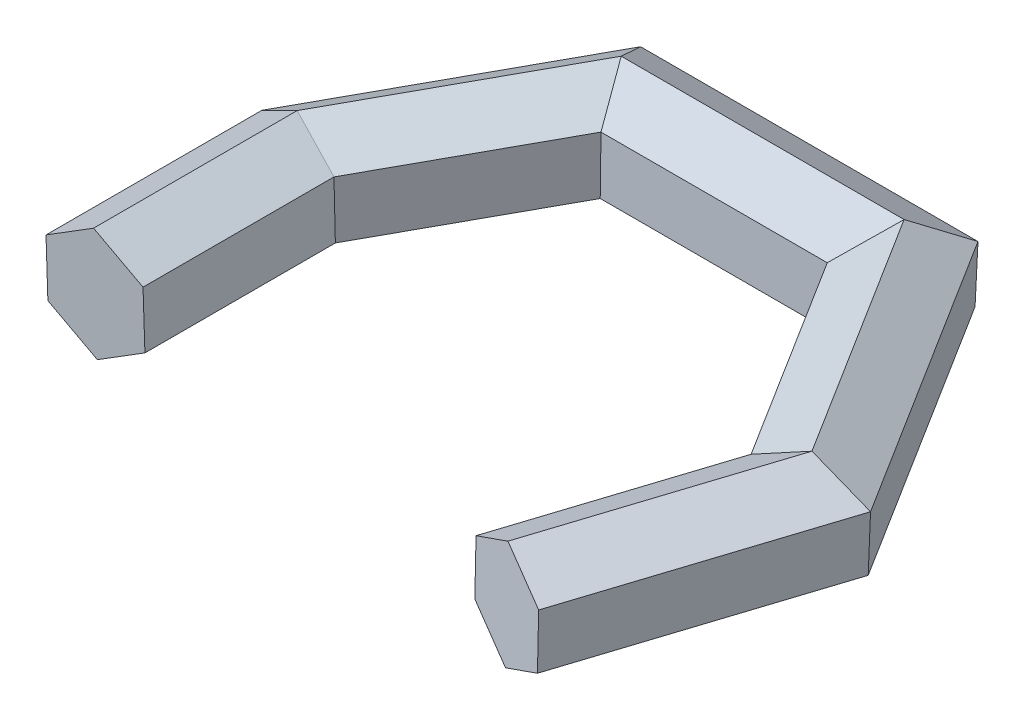
ISO-10303-21;
HEADER;
FILE_DESCRIPTION(('STEP AP214'),'2;1');
FILE_NAME('part.step','',(''),(''),'','','');
FILE_SCHEMA(('AUTOMOTIVE_DESIGN { 1 0 10303 214 1 1 1 1 }'));
ENDSEC;
DATA;
#1=APPLICATION_CONTEXT('core data for automotive mechanical design processes');
#2=APPLICATION_PROTOCOL_DEFINITION('international standard','automotive_design',2000,#1);
#3=PRODUCT_CONTEXT('',#1,'mechanical');
#4=PRODUCT('Part','Part','',(#3));
#5=PRODUCT_RELATED_PRODUCT_CATEGORY('part','',(#4));
#6=PRODUCT_DEFINITION_FORMATION('','',#4);
#7=PRODUCT_DEFINITION_CONTEXT('part definition',#1,'design');
#8=PRODUCT_DEFINITION('design','',#6,#7);
#9=PRODUCT_DEFINITION_SHAPE('','',#8);
#10=(LENGTH_UNIT() NAMED_UNIT(*) SI_UNIT(.MILLI.,.METRE.));
#11=(NAMED_UNIT(*) PLANE_ANGLE_UNIT() SI_UNIT($,.RADIAN.));
#12=(NAMED_UNIT(*) SI_UNIT($,.STERADIAN.) SOLID_ANGLE_UNIT());
#13=UNCERTAINTY_MEASURE_WITH_UNIT(LENGTH_MEASURE(1.E-05),#10,'distance_accuracy_value','');
#14=(GEOMETRIC_REPRESENTATION_CONTEXT(3) GLOBAL_UNCERTAINTY_ASSIGNED_CONTEXT((#13)) GLOBAL_UNIT_ASSIGNED_CONTEXT((#10,
#11,#12)) REPRESENTATION_CONTEXT('',''));
#15=CARTESIAN_POINT('',(0.,0.,0.));
#16=DIRECTION('',(0.,0.,1.));
#17=DIRECTION('',(1.,0.,0.));
#18=AXIS2_PLACEMENT_3D('',#15,#16,#17);
#19=CARTESIAN_POINT('',(84.6727622344032,0.,11.2963649026945));
#20=DIRECTION('',(0.306531366089456,0.,-0.951860557856733));
#21=DIRECTION('',(-0.951860557856733,0.,-0.306531366089456));
#22=AXIS2_PLACEMENT_3D('',#19,#20,#21);
#23=PLANE('',#22);
#24=DIRECTION('',(-0.80780305019403,0.528943693168032,-0.260139965316721));
#25=VECTOR('',#24,1.);
#26=CARTESIAN_POINT('',(84.3515072497639,-9.99430299214722,11.1929099076412));
#27=LINE('',#26,#25);
#28=CARTESIAN_POINT('',(84.3515072497639,-9.99430299214722,11.1929099076412));
#29=VERTEX_POINT('',#28);
#30=CARTESIAN_POINT('',(76.2734767478236,-4.7048660604669,8.59151025447399));
#31=VERTEX_POINT('',#30);
#32=EDGE_CURVE('E135',#29,#31,#27,.T.);
#33=ORIENTED_EDGE('',*,*,#32,.F.);
#34=DIRECTION('',(-0.839928548657958,-0.470486606046691,-0.270485464822054));
#35=VECTOR('',#34,1.);
#36=CARTESIAN_POINT('',(92.7507927363435,-5.28943693168031,13.8977645558617));
#37=LINE('',#36,#35);
#38=CARTESIAN_POINT('',(92.7507927363435,-5.28943693168031,13.8977645558617));
#39=VERTEX_POINT('',#38);
#40=EDGE_CURVE('E142',#39,#29,#37,.T.);
#41=ORIENTED_EDGE('',*,*,#40,.F.);
#42=DIRECTION('',(-0.0321254984639276,-0.999430299214722,-0.0103454995053326));
#43=VECTOR('',#42,1.);
#44=CARTESIAN_POINT('',(93.0720477209828,4.70486606046691,14.0012195509151));
#45=LINE('',#44,#43);
#46=CARTESIAN_POINT('',(93.0720477209828,4.70486606046691,14.0012195509151));
#47=VERTEX_POINT('',#46);
#48=EDGE_CURVE('E151',#47,#39,#45,.T.);
#49=ORIENTED_EDGE('',*,*,#48,.F.);
#50=DIRECTION('',(0.80780305019403,-0.528943693168032,0.260139965316721));
#51=VECTOR('',#50,1.);
#52=CARTESIAN_POINT('',(84.9940172190425,9.99430299214722,11.3998198977478));
#53=LINE('',#52,#51);
#54=CARTESIAN_POINT('',(84.9940172190425,9.99430299214722,11.3998198977479));
#55=VERTEX_POINT('',#54);
#56=EDGE_CURVE('E191',#55,#47,#53,.T.);
#57=ORIENTED_EDGE('',*,*,#56,.F.);
#58=DIRECTION('',(0.839928548657958,0.470486606046691,0.270485464822054));
#59=VECTOR('',#58,1.);
#60=CARTESIAN_POINT('',(76.5947317324629,5.28943693168031,8.69496524952731));
#61=LINE('',#60,#59);
#62=CARTESIAN_POINT('',(76.5947317324629,5.28943693168031,8.69496524952732));
#63=VERTEX_POINT('',#62);
#64=EDGE_CURVE('E188',#63,#55,#61,.T.);
#65=ORIENTED_EDGE('',*,*,#64,.F.);
#66=DIRECTION('',(0.0321254984639277,0.999430299214722,0.0103454995053326));
#67=VECTOR('',#66,1.);
#68=CARTESIAN_POINT('',(76.2734767478236,-4.7048660604669,8.59151025447398));
#69=LINE('',#68,#67);
#70=EDGE_CURVE('E154',#31,#63,#69,.T.);
#71=ORIENTED_EDGE('',*,*,#70,.F.);
#72=EDGE_LOOP('',(#33,#41,#49,#57,#65,#71));
#73=FACE_BOUND('',#72,.T.);
#74=ADVANCED_FACE('F39',(#73),#23,.F.);
#75=CARTESIAN_POINT('',(0.,0.,0.));
#76=DIRECTION('',(0.,0.,1.));
#77=DIRECTION('',(1.,0.,0.));
#78=AXIS2_PLACEMENT_3D('',#75,#76,#77);
#79=PLANE('',#78);
#80=DIRECTION('',(0.848656920939059,0.528943693168032,0.));
#81=VECTOR('',#80,1.);
#82=CARTESIAN_POINT('',(0.33750214985547,-9.99430299214722,0.));
#83=LINE('',#82,#81);
#84=CARTESIAN_POINT('',(0.33750214985547,-9.99430299214722,0.));
#85=VERTEX_POINT('',#84);
#86=CARTESIAN_POINT('',(8.82407135924605,-4.7048660604669,0.));
#87=VERTEX_POINT('',#86);
#88=EDGE_CURVE('E330',#85,#87,#83,.T.);
#89=ORIENTED_EDGE('',*,*,#88,.T.);
#90=DIRECTION('',(-0.0337502149855472,0.999430299214722,0.));
#91=VECTOR('',#90,1.);
#92=CARTESIAN_POINT('',(8.82407135924605,-4.7048660604669,0.));
#93=LINE('',#92,#91);
#94=CARTESIAN_POINT('',(8.48656920939058,5.28943693168031,0.));
#95=VERTEX_POINT('',#94);
#96=EDGE_CURVE('E366',#87,#95,#93,.T.);
#97=ORIENTED_EDGE('',*,*,#96,.T.);
#98=DIRECTION('',(-0.882407135924606,0.470486606046691,0.));
#99=VECTOR('',#98,1.);
#100=CARTESIAN_POINT('',(8.48656920939058,5.28943693168031,0.));
#101=LINE('',#100,#99);
#102=CARTESIAN_POINT('',(-0.337502149855472,9.99430299214722,0.));
#103=VERTEX_POINT('',#102);
#104=EDGE_CURVE('E358',#95,#103,#101,.T.);
#105=ORIENTED_EDGE('',*,*,#104,.T.);
#106=DIRECTION('',(-0.848656920939059,-0.528943693168032,0.));
#107=VECTOR('',#106,1.);
#108=CARTESIAN_POINT('',(-0.337502149855472,9.99430299214722,0.));
#109=LINE('',#108,#107);
#110=CARTESIAN_POINT('',(-8.82407135924605,4.70486606046691,0.));
#111=VERTEX_POINT('',#110);
#112=EDGE_CURVE('E350',#103,#111,#109,.T.);
#113=ORIENTED_EDGE('',*,*,#112,.T.);
#114=DIRECTION('',(0.0337502149855472,-0.999430299214722,0.));
#115=VECTOR('',#114,1.);
#116=CARTESIAN_POINT('',(-8.82407135924605,4.70486606046691,0.));
#117=LINE('',#116,#115);
#118=CARTESIAN_POINT('',(-8.48656920939058,-5.28943693168031,0.));
#119=VERTEX_POINT('',#118);
#120=EDGE_CURVE('E342',#111,#119,#117,.T.);
#121=ORIENTED_EDGE('',*,*,#120,.T.);
#122=DIRECTION('',(0.882407135924606,-0.470486606046691,0.));
#123=VECTOR('',#122,1.);
#124=CARTESIAN_POINT('',(-8.48656920939058,-5.28943693168031,0.));
#125=LINE('',#124,#123);
#126=EDGE_CURVE('E337',#119,#85,#125,.T.);
#127=ORIENTED_EDGE('',*,*,#126,.T.);
#128=EDGE_LOOP('',(#89,#97,#105,#113,#121,#127));
#129=FACE_BOUND('',#128,.T.);
#130=ADVANCED_FACE('F442',(#129),#79,.T.);
#131=CARTESIAN_POINT('',(98.9312600372874,-9.99430299214722,-34.0810592746686));
#132=DIRECTION('',(0.503480638853724,0.848656920939058,0.162137832851199));
#133=DIRECTION('',(-0.860036824777857,0.510231966879792,0.));
#134=AXIS2_PLACEMENT_3D('',#131,#132,#133);
#135=PLANE('',#134);
#136=DIRECTION('',(0.863927714724914,-0.491956600755621,-0.107738603588326));
#137=VECTOR('',#136,1.);
#138=CARTESIAN_POINT('',(79.4073817315499,0.289959399471826,-27.2838531723413));
#139=LINE('',#138,#137);
#140=CARTESIAN_POINT('',(88.1788224204781,-4.7048660604669,-28.3777210448217));
#141=VERTEX_POINT('',#140);
#142=CARTESIAN_POINT('',(97.4676319486953,-9.99430299214722,-29.5361088943036));
#143=VERTEX_POINT('',#142);
#144=EDGE_CURVE('E159',#141,#143,#139,.T.);
#145=ORIENTED_EDGE('',*,*,#144,.T.);
#146=DIRECTION('',(-0.306531366089456,0.,0.951860557856734));
#147=VECTOR('',#146,1.);
#148=CARTESIAN_POINT('',(98.9312600372874,-9.99430299214722,-34.0810592746686));
#149=LINE('',#148,#147);
#150=EDGE_CURVE('E42',#143,#29,#149,.T.);
#151=ORIENTED_EDGE('',*,*,#150,.T.);
#152=ORIENTED_EDGE('',*,*,#32,.T.);
#153=DIRECTION('',(-0.306531366089456,0.,0.951860557856734));
#154=VECTOR('',#153,1.);
#155=CARTESIAN_POINT('',(90.8532295353471,-4.7048660604669,-36.6824589278358));
#156=LINE('',#155,#154);
#157=EDGE_CURVE('E163',#141,#31,#156,.T.);
#158=ORIENTED_EDGE('',*,*,#157,.F.);
#159=EDGE_LOOP('',(#145,#151,#152,#158));
#160=FACE_BOUND('',#159,.T.);
#161=ADVANCED_FACE('F158',(#160),#135,.F.);
#162=CARTESIAN_POINT('',(90.8532295353471,-4.7048660604669,-36.6824589278358));
#163=DIRECTION('',(0.951318282149448,-0.0337502149855472,0.306356734929483));
#164=DIRECTION('',(0.306531366089456,0.,-0.951860557856734));
#165=AXIS2_PLACEMENT_3D('',#162,#163,#164);
#166=PLANE('',#165);
#167=DIRECTION('',(-0.0369360855904055,-0.9993070140383,0.00460622134896585));
#168=VECTOR('',#167,1.);
#169=CARTESIAN_POINT('',(88.1481020171724,-5.53600758525956,-28.3738899681038));
#170=LINE('',#169,#168);
#171=CARTESIAN_POINT('',(88.5482288446787,5.28943693168031,-28.4237889410375));
#172=VERTEX_POINT('',#171);
#173=EDGE_CURVE('E231',#172,#141,#170,.T.);
#174=ORIENTED_EDGE('',*,*,#173,.T.);
#175=ORIENTED_EDGE('',*,*,#157,.T.);
#176=ORIENTED_EDGE('',*,*,#70,.T.);
#177=DIRECTION('',(-0.306531366089456,0.,0.951860557856734));
#178=VECTOR('',#177,1.);
#179=CARTESIAN_POINT('',(91.1744845199864,5.28943693168031,-36.5790039327825));
#180=LINE('',#179,#178);
#181=EDGE_CURVE('E169',#172,#63,#180,.T.);
#182=ORIENTED_EDGE('',*,*,#181,.F.);
#183=EDGE_LOOP('',(#174,#175,#176,#182));
#184=FACE_BOUND('',#183,.T.);
#185=ADVANCED_FACE('F697',(#184),#166,.F.);
#186=CARTESIAN_POINT('',(91.1744845199864,5.28943693168031,-36.5790039327825));
#187=DIRECTION('',(0.447837643295725,-0.882407135924606,0.144218902078284));
#188=DIRECTION('',(0.891729445792908,0.452568884818515,0.));
#189=AXIS2_PLACEMENT_3D('',#186,#187,#188);
#190=PLANE('',#189);
#191=DIRECTION('',(-0.893407972440709,-0.435211313186122,0.111415024364727));
#192=VECTOR('',#191,1.);
#193=CARTESIAN_POINT('',(70.5217361777386,-3.49191916511637,-26.1757430519787));
#194=LINE('',#193,#192);
#195=CARTESIAN_POINT('',(98.2064447970964,9.99430299214722,-29.6282446867353));
#196=VERTEX_POINT('',#195);
#197=EDGE_CURVE('E227',#196,#172,#194,.T.);
#198=ORIENTED_EDGE('',*,*,#197,.T.);
#199=ORIENTED_EDGE('',*,*,#181,.T.);
#200=ORIENTED_EDGE('',*,*,#64,.T.);
#201=DIRECTION('',(-0.306531366089456,0.,0.951860557856734));
#202=VECTOR('',#201,1.);
#203=CARTESIAN_POINT('',(99.573770006566,9.99430299214722,-33.874149284562));
#204=LINE('',#203,#202);
#205=EDGE_CURVE('E174',#196,#55,#204,.T.);
#206=ORIENTED_EDGE('',*,*,#205,.F.);
#207=EDGE_LOOP('',(#198,#199,#200,#206));
#208=FACE_BOUND('',#207,.T.);
#209=ADVANCED_FACE('F688',(#208),#190,.F.);
#210=CARTESIAN_POINT('',(99.573770006566,9.99430299214722,-33.874149284562));
#211=DIRECTION('',(-0.503480638853723,-0.848656920939058,-0.162137832851199));
#212=DIRECTION('',(0.860036824777857,-0.510231966879791,0.));
#213=AXIS2_PLACEMENT_3D('',#210,#211,#212);
#214=PLANE('',#213);
#215=DIRECTION('',(-0.863927714724914,0.491956600755621,0.107738603588326));
#216=VECTOR('',#215,1.);
#217=CARTESIAN_POINT('',(80.0464822018124,20.3353457853742,-27.3635540443531));
#218=LINE('',#217,#216);
#219=CARTESIAN_POINT('',(107.495254325313,4.70486606046691,-30.7866325362172));
#220=VERTEX_POINT('',#219);
#221=EDGE_CURVE('E223',#220,#196,#218,.T.);
#222=ORIENTED_EDGE('',*,*,#221,.T.);
#223=ORIENTED_EDGE('',*,*,#205,.T.);
#224=ORIENTED_EDGE('',*,*,#56,.T.);
#225=DIRECTION('',(-0.306531366089456,0.,0.951860557856734));
#226=VECTOR('',#225,1.);
#227=CARTESIAN_POINT('',(107.651800508506,4.70486606046691,-31.2727496313947));
#228=LINE('',#227,#226);
#229=EDGE_CURVE('E180',#220,#47,#228,.T.);
#230=ORIENTED_EDGE('',*,*,#229,.F.);
#231=EDGE_LOOP('',(#222,#223,#224,#230));
#232=FACE_BOUND('',#231,.T.);
#233=ADVANCED_FACE('F679',(#232),#214,.F.);
#234=CARTESIAN_POINT('',(107.651800508506,4.70486606046691,-31.2727496313947));
#235=DIRECTION('',(-0.951318282149448,0.0337502149855472,-0.306356734929483));
#236=DIRECTION('',(-0.306531366089456,0.,0.951860557856734));
#237=AXIS2_PLACEMENT_3D('',#234,#235,#236);
#238=PLANE('',#237);
#239=DIRECTION('',(0.0369360855904055,0.9993070140383,-0.00460622134896585));
#240=VECTOR('',#239,1.);
#241=CARTESIAN_POINT('',(107.459768641556,3.74479971585141,-30.7822071914224));
#242=LINE('',#241,#240);
#243=CARTESIAN_POINT('',(107.125847901113,-5.28943693168031,-30.7405646400014));
#244=VERTEX_POINT('',#243);
#245=EDGE_CURVE('E219',#244,#220,#242,.T.);
#246=ORIENTED_EDGE('',*,*,#245,.T.);
#247=ORIENTED_EDGE('',*,*,#229,.T.);
#248=ORIENTED_EDGE('',*,*,#48,.T.);
#249=DIRECTION('',(-0.306531366089456,0.,0.951860557856734));
#250=VECTOR('',#249,1.);
#251=CARTESIAN_POINT('',(107.330545523867,-5.28943693168031,-31.3762046264481));
#252=LINE('',#251,#250);
#253=EDGE_CURVE('E147',#244,#39,#252,.T.);
#254=ORIENTED_EDGE('',*,*,#253,.F.);
#255=EDGE_LOOP('',(#246,#247,#248,#254));
#256=FACE_BOUND('',#255,.T.);
#257=ADVANCED_FACE('F671',(#256),#238,.F.);
#258=CARTESIAN_POINT('',(107.330545523867,-5.28943693168031,-31.3762046264481));
#259=DIRECTION('',(-0.447837643295725,0.882407135924606,-0.144218902078284));
#260=DIRECTION('',(-0.891729445792908,-0.452568884818515,0.));
#261=AXIS2_PLACEMENT_3D('',#258,#259,#260);
#262=PLANE('',#261);
#263=DIRECTION('',(0.893407972440709,0.435211313186122,-0.111415024364727));
#264=VECTOR('',#263,1.);
#265=CARTESIAN_POINT('',(86.4180298321003,-15.3769635410675,-28.1581363140078));
#266=LINE('',#265,#264);
#267=EDGE_CURVE('E198',#143,#244,#266,.T.);
#268=ORIENTED_EDGE('',*,*,#267,.T.);
#269=ORIENTED_EDGE('',*,*,#253,.T.);
#270=ORIENTED_EDGE('',*,*,#40,.T.);
#271=ORIENTED_EDGE('',*,*,#150,.F.);
#272=EDGE_LOOP('',(#268,#269,#270,#271));
#273=FACE_BOUND('',#272,.T.);
#274=ADVANCED_FACE('F144',(#273),#262,.F.);
#275=CARTESIAN_POINT('',(74.7343595452675,-5.28943693168031,-82.4423633618317));
#276=DIRECTION('',(-0.398701743172882,0.882407135924606,0.24978904391554));
#277=DIRECTION('',(-0.911294929416716,-0.411754236917342,0.));
#278=AXIS2_PLACEMENT_3D('',#275,#276,#277);
#279=PLANE('',#278);
#280=DIRECTION('',(0.530916376163004,0.,0.847424215798642));
#281=VECTOR('',#280,1.);
#282=CARTESIAN_POINT('',(67.2566277935072,-9.99430299214722,-77.757519372777));
#283=LINE('',#282,#281);
#284=CARTESIAN_POINT('',(70.2614817879104,-9.99430299214722,-72.9613101124796));
#285=VERTEX_POINT('',#284);
#286=EDGE_CURVE('E199',#285,#143,#283,.T.);
#287=ORIENTED_EDGE('',*,*,#286,.F.);
#288=DIRECTION('',(0.438890431470575,0.422751311873756,-0.792878627201283));
#289=VECTOR('',#288,1.);
#290=CARTESIAN_POINT('',(63.4676776594655,-16.5382816300273,-60.6879459546262));
#291=LINE('',#290,#289);
#292=CARTESIAN_POINT('',(75.1459626571412,-5.28943693168031,-81.7853814717257));
#293=VERTEX_POINT('',#292);
#294=EDGE_CURVE('E239',#285,#293,#291,.T.);
#295=ORIENTED_EDGE('',*,*,#294,.T.);
#296=DIRECTION('',(0.530916376163004,0.,0.847424215798642));
#297=VECTOR('',#296,1.);
#298=CARTESIAN_POINT('',(74.7343595452675,-5.28943693168031,-82.4423633618317));
#299=LINE('',#298,#297);
#300=EDGE_CURVE('E162',#293,#244,#299,.T.);
#301=ORIENTED_EDGE('',*,*,#300,.T.);
#302=ORIENTED_EDGE('',*,*,#267,.F.);
#303=EDGE_LOOP('',(#287,#295,#301,#302));
#304=FACE_BOUND('',#303,.T.);
#305=ADVANCED_FACE('F654',(#304),#279,.F.);
#306=CARTESIAN_POINT('',(75.0203670399391,4.70486606046691,-82.6215487801801));
#307=DIRECTION('',(-0.846941437557438,0.0337502149855472,0.530613912686587));
#308=DIRECTION('',(0.530916376163004,0.,0.847424215798642));
#309=AXIS2_PLACEMENT_3D('',#306,#307,#308);
#310=PLANE('',#309);
#311=ORIENTED_EDGE('',*,*,#300,.F.);
#312=DIRECTION('',(0.0186788514928966,0.999255933641991,-0.0337443267554521));
#313=VECTOR('',#312,1.);
#314=CARTESIAN_POINT('',(75.311565817154,3.56977694106128,-82.0845522823794));
#315=LINE('',#314,#313);
#316=CARTESIAN_POINT('',(75.3327837658084,4.70486606046691,-82.1228836215812));
#317=VERTEX_POINT('',#316);
#318=EDGE_CURVE('E266',#293,#317,#315,.T.);
#319=ORIENTED_EDGE('',*,*,#318,.T.);
#320=DIRECTION('',(0.530916376163004,0.,0.847424215798642));
#321=VECTOR('',#320,1.);
#322=CARTESIAN_POINT('',(75.0203670399391,4.70486606046691,-82.6215487801801));
#323=LINE('',#322,#321);
#324=EDGE_CURVE('E167',#317,#220,#323,.T.);
#325=ORIENTED_EDGE('',*,*,#324,.T.);
#326=ORIENTED_EDGE('',*,*,#245,.F.);
#327=EDGE_LOOP('',(#311,#319,#325,#326));
#328=FACE_BOUND('',#327,.T.);
#329=ADVANCED_FACE('F645',(#328),#310,.F.);
#330=CARTESIAN_POINT('',(67.8286427828504,9.99430299214722,-78.115890209474));
#331=DIRECTION('',(-0.448239694384557,-0.848656920939058,0.280824868771047));
#332=DIRECTION('',(0.884239580565024,-0.467033579266193,0.));
#333=AXIS2_PLACEMENT_3D('',#330,#331,#332);
#334=PLANE('',#333);
#335=ORIENTED_EDGE('',*,*,#324,.F.);
#336=DIRECTION('',(-0.425187640079088,0.478749701118952,0.768123814500299));
#337=VECTOR('',#336,1.);
#338=CARTESIAN_POINT('',(60.4901708657505,21.4172438906533,-55.3089234701921));
#339=LINE('',#338,#337);
#340=CARTESIAN_POINT('',(70.6351240052448,9.99430299214722,-73.6363144121906));
#341=VERTEX_POINT('',#340);
#342=EDGE_CURVE('E270',#317,#341,#339,.T.);
#343=ORIENTED_EDGE('',*,*,#342,.T.);
#344=DIRECTION('',(0.530916376163004,0.,0.847424215798642));
#345=VECTOR('',#344,1.);
#346=CARTESIAN_POINT('',(67.8286427828504,9.99430299214722,-78.115890209474));
#347=LINE('',#346,#345);
#348=EDGE_CURVE('E210',#341,#196,#347,.T.);
#349=ORIENTED_EDGE('',*,*,#348,.T.);
#350=ORIENTED_EDGE('',*,*,#221,.F.);
#351=EDGE_LOOP('',(#335,#343,#349,#350));
#352=FACE_BOUND('',#351,.T.);
#353=ADVANCED_FACE('F636',(#352),#334,.F.);
#354=CARTESIAN_POINT('',(60.3509110310901,5.28943693168031,-73.4310462204193));
#355=DIRECTION('',(0.398701743172882,-0.882407135924606,-0.24978904391554));
#356=DIRECTION('',(0.911294929416716,0.411754236917342,0.));
#357=AXIS2_PLACEMENT_3D('',#354,#355,#356);
#358=PLANE('',#357);
#359=ORIENTED_EDGE('',*,*,#348,.F.);
#360=DIRECTION('',(-0.438890431470575,-0.422751311873756,0.792878627201283));
#361=VECTOR('',#360,1.);
#362=CARTESIAN_POINT('',(55.8821297838433,-4.21618603643759,-46.9842551130633));
#363=LINE('',#362,#361);
#364=CARTESIAN_POINT('',(65.7506431360141,5.28943693168031,-64.8122430529445));
#365=VERTEX_POINT('',#364);
#366=EDGE_CURVE('E274',#341,#365,#363,.T.);
#367=ORIENTED_EDGE('',*,*,#366,.T.);
#368=DIRECTION('',(0.530916376163004,0.,0.847424215798642));
#369=VECTOR('',#368,1.);
#370=CARTESIAN_POINT('',(60.3509110310901,5.28943693168031,-73.4310462204193));
#371=LINE('',#370,#369);
#372=EDGE_CURVE('E206',#365,#172,#371,.T.);
#373=ORIENTED_EDGE('',*,*,#372,.T.);
#374=ORIENTED_EDGE('',*,*,#197,.F.);
#375=EDGE_LOOP('',(#359,#367,#373,#374));
#376=FACE_BOUND('',#375,.T.);
#377=ADVANCED_FACE('F627',(#376),#358,.F.);
#378=CARTESIAN_POINT('',(60.0649035364185,-4.7048660604669,-73.2518608020708));
#379=DIRECTION('',(0.846941437557438,-0.0337502149855472,-0.530613912686587));
#380=DIRECTION('',(-0.530916376163004,0.,-0.847424215798642));
#381=AXIS2_PLACEMENT_3D('',#378,#379,#380);
#382=PLANE('',#381);
#383=ORIENTED_EDGE('',*,*,#372,.F.);
#384=DIRECTION('',(-0.0186788514928966,-0.999255933641991,0.0337443267554522));
#385=VECTOR('',#384,1.);
#386=CARTESIAN_POINT('',(65.546012464491,-5.65761796632981,-64.4425669919358));
#387=LINE('',#386,#385);
#388=CARTESIAN_POINT('',(65.5638220273468,-4.7048660604669,-64.4747409030891));
#389=VERTEX_POINT('',#388);
#390=EDGE_CURVE('E278',#365,#389,#387,.T.);
#391=ORIENTED_EDGE('',*,*,#390,.T.);
#392=DIRECTION('',(0.530916376163004,0.,0.847424215798642));
#393=VECTOR('',#392,1.);
#394=CARTESIAN_POINT('',(60.0649035364185,-4.7048660604669,-73.2518608020708));
#395=LINE('',#394,#393);
#396=EDGE_CURVE('E202',#389,#141,#395,.T.);
#397=ORIENTED_EDGE('',*,*,#396,.T.);
#398=ORIENTED_EDGE('',*,*,#173,.F.);
#399=EDGE_LOOP('',(#383,#391,#397,#398));
#400=FACE_BOUND('',#399,.T.);
#401=ADVANCED_FACE('F618',(#400),#382,.F.);
#402=CARTESIAN_POINT('',(67.2566277935072,-9.99430299214722,-77.757519372777));
#403=DIRECTION('',(0.448239694384557,0.848656920939058,-0.280824868771047));
#404=DIRECTION('',(-0.884239580565024,0.467033579266193,0.));
#405=AXIS2_PLACEMENT_3D('',#402,#403,#404);
#406=PLANE('',#405);
#407=ORIENTED_EDGE('',*,*,#396,.F.);
#408=DIRECTION('',(0.425187640079088,-0.478749701118952,-0.768123814500299));
#409=VECTOR('',#408,1.);
#410=CARTESIAN_POINT('',(60.1840773807945,1.35257987364855,-54.7559495050637));
#411=LINE('',#410,#409);
#412=EDGE_CURVE('E235',#389,#285,#411,.T.);
#413=ORIENTED_EDGE('',*,*,#412,.T.);
#414=ORIENTED_EDGE('',*,*,#286,.T.);
#415=ORIENTED_EDGE('',*,*,#144,.F.);
#416=EDGE_LOOP('',(#407,#413,#414,#415));
#417=FACE_BOUND('',#416,.T.);
#418=ADVANCED_FACE('F610',(#417),#406,.F.);
#419=CARTESIAN_POINT('',(14.5188557597198,-5.28943693168031,-81.7853814717257));
#420=DIRECTION('',(0.,0.882407135924606,0.470486606046691));
#421=DIRECTION('',(0.,-0.470486606046691,0.882407135924606));
#422=AXIS2_PLACEMENT_3D('',#419,#420,#421);
#423=PLANE('',#422);
#424=DIRECTION('',(1.,0.,0.));
#425=VECTOR('',#424,1.);
#426=CARTESIAN_POINT('',(14.5188557597198,-9.99430299214722,-72.9613101124796));
#427=LINE('',#426,#425);
#428=CARTESIAN_POINT('',(20.5604325998855,-9.99430299214722,-72.9613101124796));
#429=VERTEX_POINT('',#428);
#430=EDGE_CURVE('E240',#429,#285,#427,.T.);
#431=ORIENTED_EDGE('',*,*,#430,.F.);
#432=DIRECTION('',(-0.462743050411294,0.417082825516576,-0.782247266505393));
#433=VECTOR('',#432,1.);
#434=CARTESIAN_POINT('',(26.0241706331903,-14.9189178400368,-63.7250954623504));
#435=LINE('',#434,#433);
#436=CARTESIAN_POINT('',(15.3405003960108,-5.28943693168031,-81.7853814717257));
#437=VERTEX_POINT('',#436);
#438=EDGE_CURVE('E287',#429,#437,#435,.T.);
#439=ORIENTED_EDGE('',*,*,#438,.T.);
#440=DIRECTION('',(1.,0.,0.));
#441=VECTOR('',#440,1.);
#442=CARTESIAN_POINT('',(14.5188557597198,-5.28943693168031,-81.7853814717257));
#443=LINE('',#442,#441);
#444=EDGE_CURVE('E234',#437,#293,#443,.T.);
#445=ORIENTED_EDGE('',*,*,#444,.T.);
#446=ORIENTED_EDGE('',*,*,#294,.F.);
#447=EDGE_LOOP('',(#431,#439,#445,#446));
#448=FACE_BOUND('',#447,.T.);
#449=ADVANCED_FACE('F471',(#448),#423,.F.);
#450=CARTESIAN_POINT('',(14.5188557597198,4.70486606046691,-82.1228836215812));
#451=DIRECTION('',(0.,0.0337502149855472,0.999430299214722));
#452=DIRECTION('',(0.,-0.999430299214722,0.0337502149855472));
#453=AXIS2_PLACEMENT_3D('',#450,#451,#452);
#454=PLANE('',#453);
#455=ORIENTED_EDGE('',*,*,#444,.F.);
#456=DIRECTION('',(-0.0199611636581535,0.99923116884776,-0.0337434904618857));
#457=VECTOR('',#456,1.);
#458=CARTESIAN_POINT('',(15.1608083474961,3.70572481063937,-82.0891431676354));
#459=LINE('',#458,#457);
#460=CARTESIAN_POINT('',(15.1408489801072,4.70486606046691,-82.1228836215812));
#461=VERTEX_POINT('',#460);
#462=EDGE_CURVE('E314',#437,#461,#459,.T.);
#463=ORIENTED_EDGE('',*,*,#462,.T.);
#464=DIRECTION('',(1.,0.,0.));
#465=VECTOR('',#464,1.);
#466=CARTESIAN_POINT('',(14.5188557597198,4.70486606046691,-82.1228836215812));
#467=LINE('',#466,#465);
#468=EDGE_CURVE('E256',#461,#317,#467,.T.);
#469=ORIENTED_EDGE('',*,*,#468,.T.);
#470=ORIENTED_EDGE('',*,*,#318,.F.);
#471=EDGE_LOOP('',(#455,#463,#469,#470));
#472=FACE_BOUND('',#471,.T.);
#473=ADVANCED_FACE('F467',(#472),#454,.F.);
#474=CARTESIAN_POINT('',(14.5188557597198,9.99430299214722,-73.6363144121906));
#475=DIRECTION('',(0.,-0.848656920939059,0.528943693168032));
#476=DIRECTION('',(0.,-0.528943693168032,-0.848656920939059));
#477=AXIS2_PLACEMENT_3D('',#474,#475,#476);
#478=PLANE('',#477);
#479=ORIENTED_EDGE('',*,*,#468,.F.);
#480=DIRECTION('',(0.44866300470271,0.472717516645569,0.758445553528783));
#481=VECTOR('',#480,1.);
#482=CARTESIAN_POINT('',(29.2341541876493,19.5537663914665,-58.2987560310591));
#483=LINE('',#482,#481);
#484=CARTESIAN_POINT('',(20.1611297680784,9.99430299214722,-73.6363144121906));
#485=VERTEX_POINT('',#484);
#486=EDGE_CURVE('E318',#461,#485,#483,.T.);
#487=ORIENTED_EDGE('',*,*,#486,.T.);
#488=DIRECTION('',(1.,0.,0.));
#489=VECTOR('',#488,1.);
#490=CARTESIAN_POINT('',(14.5188557597198,9.99430299214722,-73.6363144121906));
#491=LINE('',#490,#489);
#492=EDGE_CURVE('E252',#485,#341,#491,.T.);
#493=ORIENTED_EDGE('',*,*,#492,.T.);
#494=ORIENTED_EDGE('',*,*,#342,.F.);
#495=EDGE_LOOP('',(#479,#487,#493,#494));
#496=FACE_BOUND('',#495,.T.);
#497=ADVANCED_FACE('F463',(#496),#478,.F.);
#498=CARTESIAN_POINT('',(14.5188557597198,5.28943693168031,-64.8122430529445));
#499=DIRECTION('',(0.,-0.882407135924606,-0.470486606046691));
#500=DIRECTION('',(0.,0.470486606046691,-0.882407135924606));
#501=AXIS2_PLACEMENT_3D('',#498,#499,#500);
#502=PLANE('',#501);
#503=ORIENTED_EDGE('',*,*,#492,.F.);
#504=DIRECTION('',(0.462743050411294,-0.417082825516576,0.782247266505393));
#505=VECTOR('',#504,1.);
#506=CARTESIAN_POINT('',(33.9147354059735,-2.40219371460048,-50.3864343647775));
#507=LINE('',#506,#505);
#508=CARTESIAN_POINT('',(25.3810619719531,5.28943693168031,-64.8122430529445));
#509=VERTEX_POINT('',#508);
#510=EDGE_CURVE('E322',#485,#509,#507,.T.);
#511=ORIENTED_EDGE('',*,*,#510,.T.);
#512=DIRECTION('',(1.,0.,0.));
#513=VECTOR('',#512,1.);
#514=CARTESIAN_POINT('',(14.5188557597198,5.28943693168031,-64.8122430529445));
#515=LINE('',#514,#513);
#516=EDGE_CURVE('E248',#509,#365,#515,.T.);
#517=ORIENTED_EDGE('',*,*,#516,.T.);
#518=ORIENTED_EDGE('',*,*,#366,.F.);
#519=EDGE_LOOP('',(#503,#511,#517,#518));
#520=FACE_BOUND('',#519,.T.);
#521=ADVANCED_FACE('F460',(#520),#502,.F.);
#522=CARTESIAN_POINT('',(14.5188557597198,-4.7048660604669,-64.4747409030891));
#523=DIRECTION('',(0.,-0.0337502149855472,-0.999430299214722));
#524=DIRECTION('',(0.,0.999430299214722,-0.0337502149855472));
#525=AXIS2_PLACEMENT_3D('',#522,#523,#524);
#526=PLANE('',#525);
#527=ORIENTED_EDGE('',*,*,#516,.F.);
#528=DIRECTION('',(0.0199611636581535,-0.99923116884776,0.0337434904618857));
#529=VECTOR('',#528,1.);
#530=CARTESIAN_POINT('',(25.5965130115821,-5.49577568642243,-64.4480323172766));
#531=LINE('',#530,#529);
#532=CARTESIAN_POINT('',(25.5807133878566,-4.7048660604669,-64.4747409030891));
#533=VERTEX_POINT('',#532);
#534=EDGE_CURVE('E326',#509,#533,#531,.T.);
#535=ORIENTED_EDGE('',*,*,#534,.T.);
#536=DIRECTION('',(1.,0.,0.));
#537=VECTOR('',#536,1.);
#538=CARTESIAN_POINT('',(14.5188557597198,-4.7048660604669,-64.4747409030891));
#539=LINE('',#538,#537);
#540=EDGE_CURVE('E244',#533,#389,#539,.T.);
#541=ORIENTED_EDGE('',*,*,#540,.T.);
#542=ORIENTED_EDGE('',*,*,#390,.F.);
#543=EDGE_LOOP('',(#527,#535,#541,#542));
#544=FACE_BOUND('',#543,.T.);
#545=ADVANCED_FACE('F456',(#544),#526,.F.);
#546=CARTESIAN_POINT('',(14.5188557597198,-9.99430299214722,-72.9613101124796));
#547=DIRECTION('',(0.,0.848656920939059,-0.528943693168032));
#548=DIRECTION('',(0.,0.528943693168032,0.848656920939059));
#549=AXIS2_PLACEMENT_3D('',#546,#547,#548);
#550=PLANE('',#549);
#551=ORIENTED_EDGE('',*,*,#540,.F.);
#552=DIRECTION('',(-0.44866300470271,-0.472717516645569,-0.758445553528783));
#553=VECTOR('',#552,1.);
#554=CARTESIAN_POINT('',(29.5530779616467,-0.519528074382858,-57.759629078831));
#555=LINE('',#554,#553);
#556=EDGE_CURVE('E283',#533,#429,#555,.T.);
#557=ORIENTED_EDGE('',*,*,#556,.T.);
#558=ORIENTED_EDGE('',*,*,#430,.T.);
#559=ORIENTED_EDGE('',*,*,#412,.F.);
#560=EDGE_LOOP('',(#551,#557,#558,#559));
#561=FACE_BOUND('',#560,.T.);
#562=ADVANCED_FACE('F566',(#561),#550,.F.);
#563=CARTESIAN_POINT('',(-8.68548150868327,-5.28943693168031,-38.0580944051824));
#564=DIRECTION('',(0.41234348166384,0.882407135924606,0.226562352562549));
#565=DIRECTION('',(-0.905965255367371,0.423352047434678,0.));
#566=AXIS2_PLACEMENT_3D('',#563,#564,#565);
#567=PLANE('',#566);
#568=DIRECTION('',(0.481548995552203,0.,-0.876419171905011));
#569=VECTOR('',#568,1.);
#570=CARTESIAN_POINT('',(-0.951896195182124,-9.99430299214722,-33.8088717054565));
#571=LINE('',#570,#569);
#572=CARTESIAN_POINT('',(0.337502149855471,-9.99430299214722,-36.1555766934249));
#573=VERTEX_POINT('',#572);
#574=EDGE_CURVE('E288',#573,#429,#571,.T.);
#575=ORIENTED_EDGE('',*,*,#574,.F.);
#576=DIRECTION('',(-0.860616238135255,0.458868017385937,-0.220861570396983));
#577=VECTOR('',#576,1.);
#578=CARTESIAN_POINT('',(-1.18378698102229,-9.18317383094384,-36.5459879959139));
#579=LINE('',#578,#577);
#580=CARTESIAN_POINT('',(-8.48656920939058,-5.28943693168031,-38.4201147898951));
#581=VERTEX_POINT('',#580);
#582=EDGE_CURVE('E335',#573,#581,#579,.T.);
#583=ORIENTED_EDGE('',*,*,#582,.T.);
#584=DIRECTION('',(0.481548995552203,0.,-0.876419171905011));
#585=VECTOR('',#584,1.);
#586=CARTESIAN_POINT('',(-8.68548150868327,-5.28943693168031,-38.0580944051824));
#587=LINE('',#586,#585);
#588=EDGE_CURVE('E282',#581,#437,#587,.T.);
#589=ORIENTED_EDGE('',*,*,#588,.T.);
#590=ORIENTED_EDGE('',*,*,#438,.F.);
#591=EDGE_LOOP('',(#575,#583,#589,#590));
#592=FACE_BOUND('',#591,.T.);
#593=ADVANCED_FACE('F474',(#592),#567,.F.);
#594=CARTESIAN_POINT('',(-8.98127486337576,4.70486606046691,-38.220618226442));
#595=DIRECTION('',(0.875919875214544,0.0337502149855472,0.481274656711287));
#596=DIRECTION('',(0.481548995552203,0.,-0.876419171905011));
#597=AXIS2_PLACEMENT_3D('',#594,#595,#596);
#598=PLANE('',#597);
#599=ORIENTED_EDGE('',*,*,#588,.F.);
#600=DIRECTION('',(-0.0337489490941749,0.999392812929271,-0.00866105653820566));
#601=VECTOR('',#600,1.);
#602=CARTESIAN_POINT('',(-8.81281578255057,4.37155960925125,-38.5038400640555));
#603=LINE('',#602,#601);
#604=CARTESIAN_POINT('',(-8.82407135924605,4.70486606046691,-38.5067286039581));
#605=VERTEX_POINT('',#604);
#606=EDGE_CURVE('E385',#581,#605,#603,.T.);
#607=ORIENTED_EDGE('',*,*,#606,.T.);
#608=DIRECTION('',(0.481548995552203,0.,-0.876419171905011));
#609=VECTOR('',#608,1.);
#610=CARTESIAN_POINT('',(-8.98127486337576,4.70486606046691,-38.220618226442));
#611=LINE('',#610,#609);
#612=EDGE_CURVE('E304',#605,#461,#611,.T.);
#613=ORIENTED_EDGE('',*,*,#612,.T.);
#614=ORIENTED_EDGE('',*,*,#462,.F.);
#615=EDGE_LOOP('',(#599,#607,#613,#614));
#616=FACE_BOUND('',#615,.T.);
#617=ADVANCED_FACE('F437',(#616),#598,.F.);
#618=CARTESIAN_POINT('',(-1.54348290456711,9.99430299214722,-34.1339193479757));
#619=DIRECTION('',(0.463576393550704,-0.848656920939058,0.254712304148738));
#620=DIRECTION('',(0.877603008124151,0.479388110127317,0.));
#621=AXIS2_PLACEMENT_3D('',#618,#619,#620);
#622=PLANE('',#621);
#623=ORIENTED_EDGE('',*,*,#612,.F.);
#624=DIRECTION('',(0.829218377877069,0.516828202793385,0.212803878226599));
#625=VECTOR('',#624,1.);
#626=CARTESIAN_POINT('',(6.07311087380351,13.9898555464741,-34.6836365953638));
#627=LINE('',#626,#625);
#628=CARTESIAN_POINT('',(-0.337502149855473,9.99430299214722,-36.3288043215509));
#629=VERTEX_POINT('',#628);
#630=EDGE_CURVE('E389',#605,#629,#627,.T.);
#631=ORIENTED_EDGE('',*,*,#630,.T.);
#632=DIRECTION('',(0.481548995552203,0.,-0.876419171905011));
#633=VECTOR('',#632,1.);
#634=CARTESIAN_POINT('',(-1.54348290456711,9.99430299214722,-34.1339193479757));
#635=LINE('',#634,#633);
#636=EDGE_CURVE('E300',#629,#485,#635,.T.);
#637=ORIENTED_EDGE('',*,*,#636,.T.);
#638=ORIENTED_EDGE('',*,*,#486,.F.);
#639=EDGE_LOOP('',(#623,#631,#637,#638));
#640=FACE_BOUND('',#639,.T.);
#641=ADVANCED_FACE('F433',(#640),#622,.F.);
#642=CARTESIAN_POINT('',(6.19010240893404,5.28943693168031,-29.8846966482498));
#643=DIRECTION('',(-0.41234348166384,-0.882407135924606,-0.226562352562549));
#644=DIRECTION('',(0.905965255367371,-0.423352047434678,0.));
#645=AXIS2_PLACEMENT_3D('',#642,#643,#644);
#646=PLANE('',#645);
#647=ORIENTED_EDGE('',*,*,#636,.F.);
#648=DIRECTION('',(0.860616238135255,-0.458868017385937,0.220861570396983));
#649=VECTOR('',#648,1.);
#650=CARTESIAN_POINT('',(14.9614045754825,1.83714921540784,-32.4026169978763));
#651=LINE('',#650,#649);
#652=CARTESIAN_POINT('',(8.48656920939058,5.28943693168031,-34.0642662250807));
#653=VERTEX_POINT('',#652);
#654=EDGE_CURVE('E49',#629,#653,#651,.T.);
#655=ORIENTED_EDGE('',*,*,#654,.T.);
#656=DIRECTION('',(0.481548995552203,0.,-0.876419171905011));
#657=VECTOR('',#656,1.);
#658=CARTESIAN_POINT('',(6.19010240893404,5.28943693168031,-29.8846966482498));
#659=LINE('',#658,#657);
#660=EDGE_CURVE('E296',#653,#509,#659,.T.);
#661=ORIENTED_EDGE('',*,*,#660,.T.);
#662=ORIENTED_EDGE('',*,*,#510,.F.);
#663=EDGE_LOOP('',(#647,#655,#661,#662));
#664=FACE_BOUND('',#663,.T.);
#665=ADVANCED_FACE('F397',(#664),#646,.F.);
#666=CARTESIAN_POINT('',(6.48589576362653,-4.7048660604669,-29.7221728269902));
#667=DIRECTION('',(-0.875919875214544,-0.0337502149855472,-0.481274656711287));
#668=DIRECTION('',(-0.481548995552203,0.,0.876419171905011));
#669=AXIS2_PLACEMENT_3D('',#666,#667,#668);
#670=PLANE('',#669);
#671=ORIENTED_EDGE('',*,*,#660,.F.);
#672=DIRECTION('',(0.0337489490941749,-0.999392812929271,0.00866105653820566));
#673=VECTOR('',#672,1.);
#674=CARTESIAN_POINT('',(8.83400307992214,-4.99896974458489,-33.9751036147854));
#675=LINE('',#674,#673);
#676=CARTESIAN_POINT('',(8.82407135924605,-4.7048660604669,-33.9776524110177));
#677=VERTEX_POINT('',#676);
#678=EDGE_CURVE('E11',#653,#677,#675,.T.);
#679=ORIENTED_EDGE('',*,*,#678,.T.);
#680=DIRECTION('',(0.481548995552203,0.,-0.876419171905011));
#681=VECTOR('',#680,1.);
#682=CARTESIAN_POINT('',(6.48589576362653,-4.7048660604669,-29.7221728269902));
#683=LINE('',#682,#681);
#684=EDGE_CURVE('E292',#677,#533,#683,.T.);
#685=ORIENTED_EDGE('',*,*,#684,.T.);
#686=ORIENTED_EDGE('',*,*,#534,.F.);
#687=EDGE_LOOP('',(#671,#679,#685,#686));
#688=FACE_BOUND('',#687,.T.);
#689=ADVANCED_FACE('F453',(#688),#670,.F.);
#690=CARTESIAN_POINT('',(-0.951896195182124,-9.99430299214722,-33.8088717054565));
#691=DIRECTION('',(-0.463576393550704,0.848656920939058,-0.254712304148738));
#692=DIRECTION('',(-0.877603008124151,-0.479388110127317,0.));
#693=AXIS2_PLACEMENT_3D('',#690,#691,#692);
#694=PLANE('',#693);
#695=ORIENTED_EDGE('',*,*,#684,.F.);
#696=DIRECTION('',(-0.829218377877069,-0.516828202793385,-0.212803878226599));
#697=VECTOR('',#696,1.);
#698=CARTESIAN_POINT('',(6.71754727265284,-6.01780254000106,-34.5182536653609));
#699=LINE('',#698,#697);
#700=EDGE_CURVE('E331',#677,#573,#699,.T.);
#701=ORIENTED_EDGE('',*,*,#700,.T.);
#702=ORIENTED_EDGE('',*,*,#574,.T.);
#703=ORIENTED_EDGE('',*,*,#556,.F.);
#704=EDGE_LOOP('',(#695,#701,#702,#703));
#705=FACE_BOUND('',#704,.T.);
#706=ADVANCED_FACE('F450',(#705),#694,.F.);
#707=CARTESIAN_POINT('',(-8.48656920939058,-5.28943693168031,0.));
#708=DIRECTION('',(0.470486606046691,0.882407135924606,0.));
#709=DIRECTION('',(-0.882407135924606,0.470486606046691,0.));
#710=AXIS2_PLACEMENT_3D('',#707,#708,#709);
#711=PLANE('',#710);
#712=DIRECTION('',(0.,0.,-1.));
#713=VECTOR('',#712,1.);
#714=CARTESIAN_POINT('',(0.33750214985547,-9.99430299214722,0.));
#715=LINE('',#714,#713);
#716=EDGE_CURVE('E341',#85,#573,#715,.T.);
#717=ORIENTED_EDGE('',*,*,#716,.F.);
#718=ORIENTED_EDGE('',*,*,#126,.F.);
#719=DIRECTION('',(0.,0.,-1.));
#720=VECTOR('',#719,1.);
#721=CARTESIAN_POINT('',(-8.48656920939058,-5.28943693168031,0.));
#722=LINE('',#721,#720);
#723=EDGE_CURVE('E336',#119,#581,#722,.T.);
#724=ORIENTED_EDGE('',*,*,#723,.T.);
#725=ORIENTED_EDGE('',*,*,#582,.F.);
#726=EDGE_LOOP('',(#717,#718,#724,#725));
#727=FACE_BOUND('',#726,.T.);
#728=ADVANCED_FACE('F476',(#727),#711,.F.);
#729=CARTESIAN_POINT('',(-8.82407135924605,4.70486606046691,0.));
#730=DIRECTION('',(0.999430299214722,0.0337502149855472,0.));
#731=DIRECTION('',(-0.0337502149855472,0.999430299214722,0.));
#732=AXIS2_PLACEMENT_3D('',#729,#730,#731);
#733=PLANE('',#732);
#734=ORIENTED_EDGE('',*,*,#723,.F.);
#735=ORIENTED_EDGE('',*,*,#120,.F.);
#736=DIRECTION('',(0.,0.,-1.));
#737=VECTOR('',#736,1.);
#738=CARTESIAN_POINT('',(-8.82407135924605,4.70486606046691,0.));
#739=LINE('',#738,#737);
#740=EDGE_CURVE('E346',#111,#605,#739,.T.);
#741=ORIENTED_EDGE('',*,*,#740,.T.);
#742=ORIENTED_EDGE('',*,*,#606,.F.);
#743=EDGE_LOOP('',(#734,#735,#741,#742));
#744=FACE_BOUND('',#743,.T.);
#745=ADVANCED_FACE('F440',(#744),#733,.F.);
#746=CARTESIAN_POINT('',(-0.337502149855472,9.99430299214722,0.));
#747=DIRECTION('',(0.528943693168032,-0.848656920939059,0.));
#748=DIRECTION('',(0.848656920939059,0.528943693168032,0.));
#749=AXIS2_PLACEMENT_3D('',#746,#747,#748);
#750=PLANE('',#749);
#751=ORIENTED_EDGE('',*,*,#740,.F.);
#752=ORIENTED_EDGE('',*,*,#112,.F.);
#753=DIRECTION('',(0.,0.,-1.));
#754=VECTOR('',#753,1.);
#755=CARTESIAN_POINT('',(-0.337502149855472,9.99430299214722,0.));
#756=LINE('',#755,#754);
#757=EDGE_CURVE('E354',#103,#629,#756,.T.);
#758=ORIENTED_EDGE('',*,*,#757,.T.);
#759=ORIENTED_EDGE('',*,*,#630,.F.);
#760=EDGE_LOOP('',(#751,#752,#758,#759));
#761=FACE_BOUND('',#760,.T.);
#762=ADVANCED_FACE('F431',(#761),#750,.F.);
#763=CARTESIAN_POINT('',(8.48656920939058,5.28943693168031,0.));
#764=DIRECTION('',(-0.470486606046691,-0.882407135924606,0.));
#765=DIRECTION('',(0.882407135924606,-0.470486606046691,0.));
#766=AXIS2_PLACEMENT_3D('',#763,#764,#765);
#767=PLANE('',#766);
#768=ORIENTED_EDGE('',*,*,#757,.F.);
#769=ORIENTED_EDGE('',*,*,#104,.F.);
#770=DIRECTION('',(0.,0.,-1.));
#771=VECTOR('',#770,1.);
#772=CARTESIAN_POINT('',(8.48656920939058,5.28943693168031,0.));
#773=LINE('',#772,#771);
#774=EDGE_CURVE('E362',#95,#653,#773,.T.);
#775=ORIENTED_EDGE('',*,*,#774,.T.);
#776=ORIENTED_EDGE('',*,*,#654,.F.);
#777=EDGE_LOOP('',(#768,#769,#775,#776));
#778=FACE_BOUND('',#777,.T.);
#779=ADVANCED_FACE('F401',(#778),#767,.F.);
#780=CARTESIAN_POINT('',(8.82407135924605,-4.7048660604669,0.));
#781=DIRECTION('',(-0.999430299214722,-0.0337502149855472,0.));
#782=DIRECTION('',(0.0337502149855472,-0.999430299214722,0.));
#783=AXIS2_PLACEMENT_3D('',#780,#781,#782);
#784=PLANE('',#783);
#785=ORIENTED_EDGE('',*,*,#774,.F.);
#786=ORIENTED_EDGE('',*,*,#96,.F.);
#787=DIRECTION('',(0.,0.,-1.));
#788=VECTOR('',#787,1.);
#789=CARTESIAN_POINT('',(8.82407135924605,-4.7048660604669,0.));
#790=LINE('',#789,#788);
#791=EDGE_CURVE('E370',#87,#677,#790,.T.);
#792=ORIENTED_EDGE('',*,*,#791,.T.);
#793=ORIENTED_EDGE('',*,*,#678,.F.);
#794=EDGE_LOOP('',(#785,#786,#792,#793));
#795=FACE_BOUND('',#794,.T.);
#796=ADVANCED_FACE('F404',(#795),#784,.F.);
#797=CARTESIAN_POINT('',(0.33750214985547,-9.99430299214722,0.));
#798=DIRECTION('',(-0.528943693168032,0.848656920939058,0.));
#799=DIRECTION('',(-0.848656920939059,-0.528943693168032,0.));
#800=AXIS2_PLACEMENT_3D('',#797,#798,#799);
#801=PLANE('',#800);
#802=ORIENTED_EDGE('',*,*,#791,.F.);
#803=ORIENTED_EDGE('',*,*,#88,.F.);
#804=ORIENTED_EDGE('',*,*,#716,.T.);
#805=ORIENTED_EDGE('',*,*,#700,.F.);
#806=EDGE_LOOP('',(#802,#803,#804,#805));
#807=FACE_BOUND('',#806,.T.);
#808=ADVANCED_FACE('F447',(#807),#801,.F.);
#809=CLOSED_SHELL('',(#74,#130,#161,#185,#209,#233,#257,#274,#305,#329,#353,#377,#401,#418,#449,
#473,#497,#521,#545,#562,#593,#617,#641,#665,#689,#706,#728,#745,#762,#779,#796,#808));
#810=MANIFOLD_SOLID_BREP('B2',#809);
#811=ADVANCED_BREP_SHAPE_REPRESENTATION('',(#18,#810),#14);
#812=SHAPE_DEFINITION_REPRESENTATION(#9,#811);
ENDSEC;
END-ISO-10303-21;
